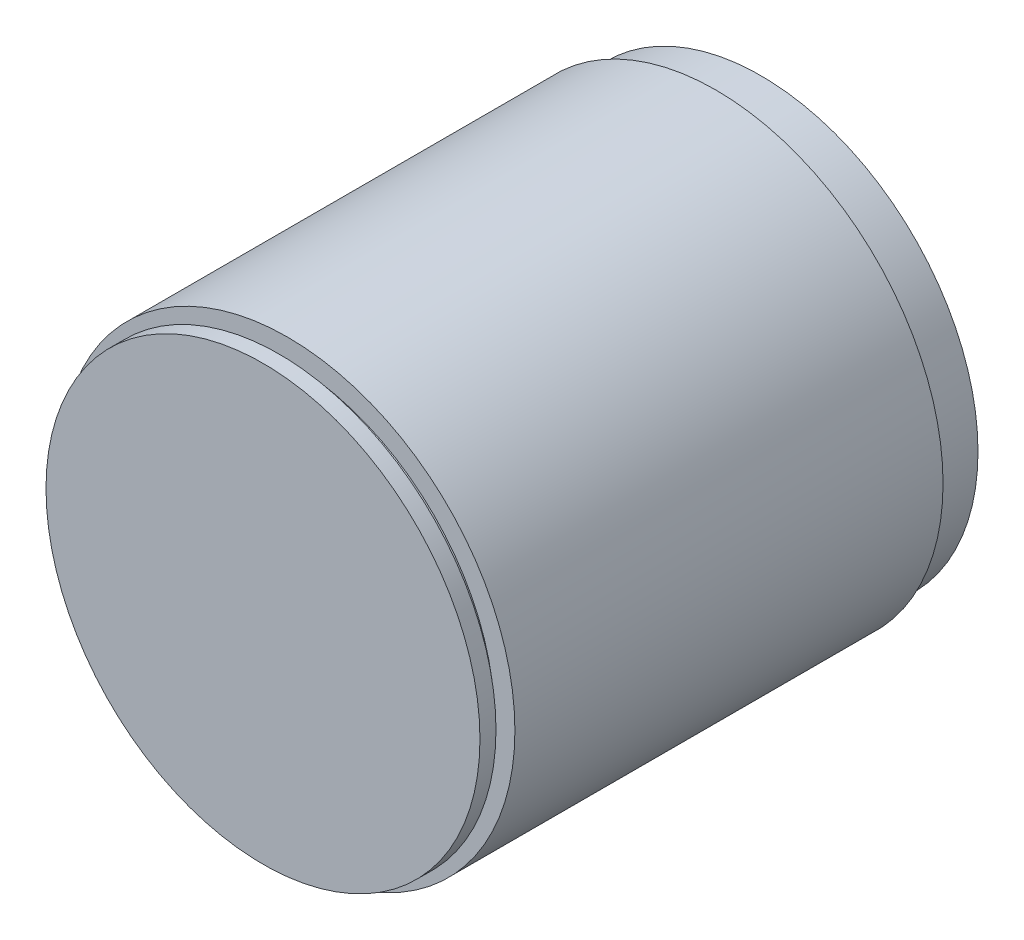
ISO-10303-21;
HEADER;
FILE_DESCRIPTION(('STEP AP214'),'2;1');
FILE_NAME('part.step','',(''),(''),'','','');
FILE_SCHEMA(('AUTOMOTIVE_DESIGN { 1 0 10303 214 1 1 1 1 }'));
ENDSEC;
DATA;
#1=APPLICATION_CONTEXT('core data for automotive mechanical design processes');
#2=APPLICATION_PROTOCOL_DEFINITION('international standard','automotive_design',2000,#1);
#3=PRODUCT_CONTEXT('',#1,'mechanical');
#4=PRODUCT('Part','Part','',(#3));
#5=PRODUCT_RELATED_PRODUCT_CATEGORY('part','',(#4));
#6=PRODUCT_DEFINITION_FORMATION('','',#4);
#7=PRODUCT_DEFINITION_CONTEXT('part definition',#1,'design');
#8=PRODUCT_DEFINITION('design','',#6,#7);
#9=PRODUCT_DEFINITION_SHAPE('','',#8);
#10=(LENGTH_UNIT() NAMED_UNIT(*) SI_UNIT(.MILLI.,.METRE.));
#11=(NAMED_UNIT(*) PLANE_ANGLE_UNIT() SI_UNIT($,.RADIAN.));
#12=(NAMED_UNIT(*) SI_UNIT($,.STERADIAN.) SOLID_ANGLE_UNIT());
#13=UNCERTAINTY_MEASURE_WITH_UNIT(LENGTH_MEASURE(1.E-05),#10,'distance_accuracy_value','');
#14=(GEOMETRIC_REPRESENTATION_CONTEXT(3) GLOBAL_UNCERTAINTY_ASSIGNED_CONTEXT((#13)) GLOBAL_UNIT_ASSIGNED_CONTEXT((#10,
#11,#12)) REPRESENTATION_CONTEXT('',''));
#15=CARTESIAN_POINT('',(0.,0.,0.));
#16=DIRECTION('',(0.,0.,1.));
#17=DIRECTION('',(1.,0.,0.));
#18=AXIS2_PLACEMENT_3D('',#15,#16,#17);
#19=CARTESIAN_POINT('',(101.811190523648,0.,88.1243087787238));
#20=DIRECTION('',(0.,0.,-1.));
#21=DIRECTION('',(-1.,0.,0.));
#22=AXIS2_PLACEMENT_3D('',#19,#20,#21);
#23=PLANE('',#22);
#24=CARTESIAN_POINT('',(101.811190523648,0.,88.1243087787238));
#25=DIRECTION('',(0.,0.,-1.));
#26=DIRECTION('',(-1.,0.,0.));
#27=AXIS2_PLACEMENT_3D('',#24,#25,#26);
#28=CIRCLE('',#27,71.5559782453942);
#29=CARTESIAN_POINT('',(30.2552122782539,0.,88.1243087787238));
#30=VERTEX_POINT('',#29);
#31=EDGE_CURVE('E10',#30,#30,#28,.T.);
#32=ORIENTED_EDGE('',*,*,#31,.F.);
#33=EDGE_LOOP('',(#32));
#34=FACE_BOUND('',#33,.T.);
#35=ADVANCED_FACE('F31',(#34),#23,.F.);
#36=CARTESIAN_POINT('',(101.811190523648,0.,-76.118272160369));
#37=DIRECTION('',(0.,0.,-1.));
#38=DIRECTION('',(-1.,0.,0.));
#39=AXIS2_PLACEMENT_3D('',#36,#37,#38);
#40=CYLINDRICAL_SURFACE('',#39,71.5559782453942);
#41=CARTESIAN_POINT('',(101.811190523648,0.,82.8416526666477));
#42=DIRECTION('',(0.,0.,-1.));
#43=DIRECTION('',(-1.,0.,0.));
#44=AXIS2_PLACEMENT_3D('',#41,#42,#43);
#45=CIRCLE('',#44,71.5559782453942);
#46=CARTESIAN_POINT('',(30.2552122782539,0.,82.8416526666477));
#47=VERTEX_POINT('',#46);
#48=EDGE_CURVE('E37',#47,#47,#45,.T.);
#49=ORIENTED_EDGE('',*,*,#48,.F.);
#50=EDGE_LOOP('',(#49));
#51=FACE_BOUND('',#50,.T.);
#52=ORIENTED_EDGE('',*,*,#31,.T.);
#53=EDGE_LOOP('',(#52));
#54=FACE_BOUND('',#53,.T.);
#55=ADVANCED_FACE('F97',(#51,#54),#40,.T.);
#56=CARTESIAN_POINT('',(173.367168769042,0.,82.8416526666477));
#57=DIRECTION('',(0.,0.,1.));
#58=DIRECTION('',(1.,0.,0.));
#59=AXIS2_PLACEMENT_3D('',#56,#57,#58);
#60=PLANE('',#59);
#61=CARTESIAN_POINT('',(101.811190523648,0.,82.8416526666477));
#62=DIRECTION('',(0.,0.,-1.));
#63=DIRECTION('',(-1.,0.,0.));
#64=AXIS2_PLACEMENT_3D('',#61,#62,#63);
#65=CIRCLE('',#64,68.194287992255);
#66=CARTESIAN_POINT('',(33.6169025313932,0.,82.8416526666477));
#67=VERTEX_POINT('',#66);
#68=EDGE_CURVE('E41',#67,#67,#65,.T.);
#69=ORIENTED_EDGE('',*,*,#68,.F.);
#70=EDGE_LOOP('',(#69));
#71=FACE_BOUND('',#70,.T.);
#72=ORIENTED_EDGE('',*,*,#48,.T.);
#73=EDGE_LOOP('',(#72));
#74=FACE_BOUND('',#73,.T.);
#75=ADVANCED_FACE('F92',(#71,#74),#60,.F.);
#76=CARTESIAN_POINT('',(101.811190523648,0.,-76.118272160369));
#77=DIRECTION('',(0.,0.,-1.));
#78=DIRECTION('',(-1.,0.,0.));
#79=AXIS2_PLACEMENT_3D('',#76,#77,#78);
#80=CYLINDRICAL_SURFACE('',#79,68.194287992255);
#81=CARTESIAN_POINT('',(101.811190523648,0.,79.9602038782425));
#82=DIRECTION('',(0.,0.,-1.));
#83=DIRECTION('',(-1.,0.,0.));
#84=AXIS2_PLACEMENT_3D('',#81,#82,#83);
#85=CIRCLE('',#84,68.194287992255);
#86=CARTESIAN_POINT('',(33.6169025313932,0.,79.9602038782425));
#87=VERTEX_POINT('',#86);
#88=EDGE_CURVE('E45',#87,#87,#85,.T.);
#89=ORIENTED_EDGE('',*,*,#88,.F.);
#90=EDGE_LOOP('',(#89));
#91=FACE_BOUND('',#90,.T.);
#92=ORIENTED_EDGE('',*,*,#68,.T.);
#93=EDGE_LOOP('',(#92));
#94=FACE_BOUND('',#93,.T.);
#95=ADVANCED_FACE('F86',(#91,#94),#80,.T.);
#96=CARTESIAN_POINT('',(170.005478515903,0.,79.9602038782425));
#97=DIRECTION('',(0.,0.,-1.));
#98=DIRECTION('',(-1.,0.,0.));
#99=AXIS2_PLACEMENT_3D('',#96,#97,#98);
#100=PLANE('',#99);
#101=CARTESIAN_POINT('',(101.811190523648,0.,79.9602038782425));
#102=DIRECTION('',(0.,0.,-1.));
#103=DIRECTION('',(-1.,0.,0.));
#104=AXIS2_PLACEMENT_3D('',#101,#102,#103);
#105=CIRCLE('',#104,74.9176684985336);
#106=CARTESIAN_POINT('',(26.8935220251146,0.,79.9602038782425));
#107=VERTEX_POINT('',#106);
#108=EDGE_CURVE('E50',#107,#107,#105,.T.);
#109=ORIENTED_EDGE('',*,*,#108,.F.);
#110=EDGE_LOOP('',(#109));
#111=FACE_BOUND('',#110,.T.);
#112=ORIENTED_EDGE('',*,*,#88,.T.);
#113=EDGE_LOOP('',(#112));
#114=FACE_BOUND('',#113,.T.);
#115=ADVANCED_FACE('F80',(#111,#114),#100,.F.);
#116=CARTESIAN_POINT('',(101.811190523648,0.,-76.118272160369));
#117=DIRECTION('',(0.,0.,-1.));
#118=DIRECTION('',(-1.,0.,0.));
#119=AXIS2_PLACEMENT_3D('',#116,#117,#118);
#120=CYLINDRICAL_SURFACE('',#119,74.9176684985336);
#121=CARTESIAN_POINT('',(101.811190523648,0.,-61.2307867536092));
#122=DIRECTION('',(0.,0.,-1.));
#123=DIRECTION('',(-1.,0.,0.));
#124=AXIS2_PLACEMENT_3D('',#121,#122,#123);
#125=CIRCLE('',#124,74.9176684985336);
#126=CARTESIAN_POINT('',(26.8935220251146,0.,-61.2307867536092));
#127=VERTEX_POINT('',#126);
#128=EDGE_CURVE('E53',#127,#127,#125,.T.);
#129=ORIENTED_EDGE('',*,*,#128,.F.);
#130=EDGE_LOOP('',(#129));
#131=FACE_BOUND('',#130,.T.);
#132=ORIENTED_EDGE('',*,*,#108,.T.);
#133=EDGE_LOOP('',(#132));
#134=FACE_BOUND('',#133,.T.);
#135=ADVANCED_FACE('F74',(#131,#134),#120,.T.);
#136=CARTESIAN_POINT('',(176.728859022182,0.,-61.2307867536092));
#137=DIRECTION('',(0.,0.,1.));
#138=DIRECTION('',(1.,0.,0.));
#139=AXIS2_PLACEMENT_3D('',#136,#137,#138);
#140=PLANE('',#139);
#141=CARTESIAN_POINT('',(101.811190523648,0.,-61.2307867536092));
#142=DIRECTION('',(0.,0.,-1.));
#143=DIRECTION('',(-1.,0.,0.));
#144=AXIS2_PLACEMENT_3D('',#141,#142,#143);
#145=CIRCLE('',#144,71.5559782453943);
#146=CARTESIAN_POINT('',(30.2552122782539,0.,-61.2307867536092));
#147=VERTEX_POINT('',#146);
#148=EDGE_CURVE('E56',#147,#147,#145,.T.);
#149=ORIENTED_EDGE('',*,*,#148,.F.);
#150=EDGE_LOOP('',(#149));
#151=FACE_BOUND('',#150,.T.);
#152=ORIENTED_EDGE('',*,*,#128,.T.);
#153=EDGE_LOOP('',(#152));
#154=FACE_BOUND('',#153,.T.);
#155=ADVANCED_FACE('F68',(#151,#154),#140,.F.);
#156=CARTESIAN_POINT('',(101.811190523648,0.,-76.118272160369));
#157=DIRECTION('',(0.,0.,-1.));
#158=DIRECTION('',(-1.,0.,0.));
#159=AXIS2_PLACEMENT_3D('',#156,#157,#158);
#160=CYLINDRICAL_SURFACE('',#159,71.5559782453943);
#161=CARTESIAN_POINT('',(101.811190523648,0.,-76.118272160369));
#162=DIRECTION('',(0.,0.,-1.));
#163=DIRECTION('',(-1.,0.,0.));
#164=AXIS2_PLACEMENT_3D('',#161,#162,#163);
#165=CIRCLE('',#164,71.5559782453943);
#166=CARTESIAN_POINT('',(30.2552122782539,0.,-76.118272160369));
#167=VERTEX_POINT('',#166);
#168=EDGE_CURVE('E59',#167,#167,#165,.T.);
#169=ORIENTED_EDGE('',*,*,#168,.F.);
#170=EDGE_LOOP('',(#169));
#171=FACE_BOUND('',#170,.T.);
#172=ORIENTED_EDGE('',*,*,#148,.T.);
#173=EDGE_LOOP('',(#172));
#174=FACE_BOUND('',#173,.T.);
#175=ADVANCED_FACE('F65',(#171,#174),#160,.T.);
#176=CARTESIAN_POINT('',(173.367168769042,0.,-76.118272160369));
#177=DIRECTION('',(0.,0.,1.));
#178=DIRECTION('',(1.,0.,0.));
#179=AXIS2_PLACEMENT_3D('',#176,#177,#178);
#180=PLANE('',#179);
#181=ORIENTED_EDGE('',*,*,#168,.T.);
#182=EDGE_LOOP('',(#181));
#183=FACE_BOUND('',#182,.T.);
#184=ADVANCED_FACE('F63',(#183),#180,.F.);
#185=CLOSED_SHELL('',(#35,#55,#75,#95,#115,#135,#155,#175,#184));
#186=MANIFOLD_SOLID_BREP('B2',#185);
#187=ADVANCED_BREP_SHAPE_REPRESENTATION('',(#18,#186),#14);
#188=SHAPE_DEFINITION_REPRESENTATION(#9,#187);
ENDSEC;
END-ISO-10303-21;
